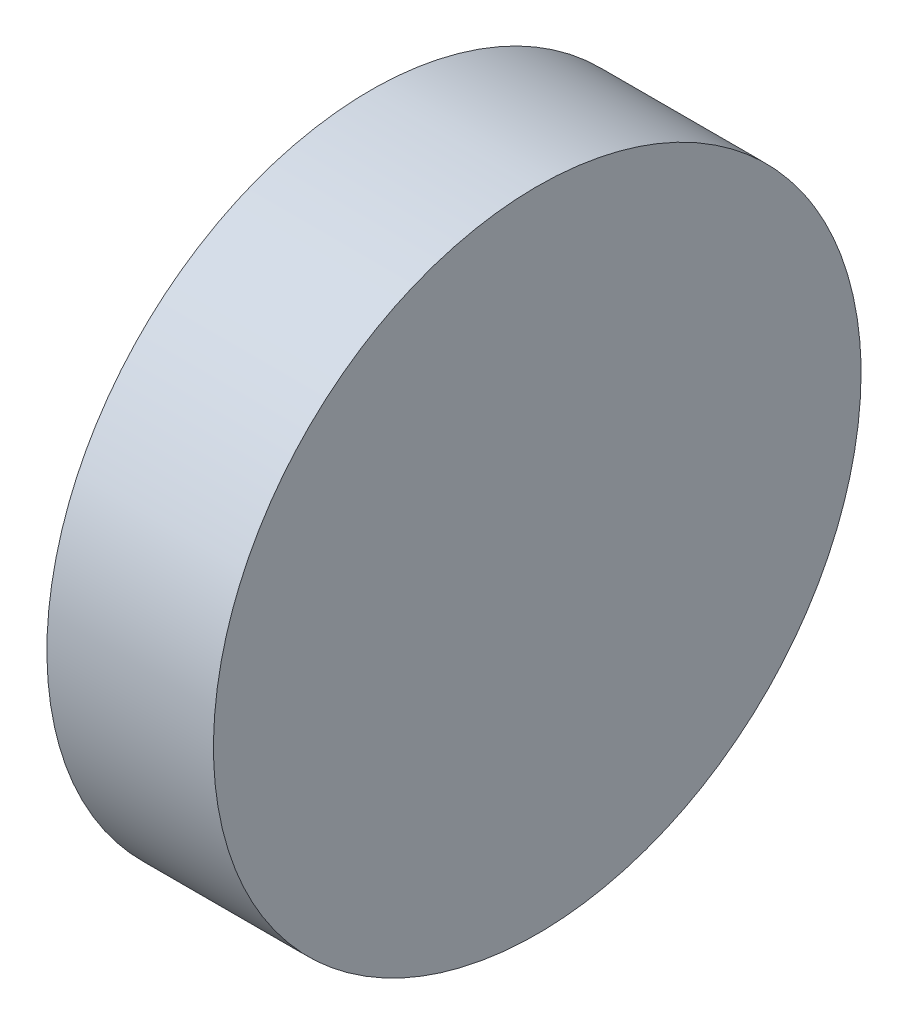
ISO-10303-21;
HEADER;
FILE_DESCRIPTION(('STEP AP214'),'2;1');
FILE_NAME('part.step','',(''),(''),'','','');
FILE_SCHEMA(('AUTOMOTIVE_DESIGN { 1 0 10303 214 1 1 1 1 }'));
ENDSEC;
DATA;
#1=APPLICATION_CONTEXT('core data for automotive mechanical design processes');
#2=APPLICATION_PROTOCOL_DEFINITION('international standard','automotive_design',2000,#1);
#3=PRODUCT_CONTEXT('',#1,'mechanical');
#4=PRODUCT('Part','Part','',(#3));
#5=PRODUCT_RELATED_PRODUCT_CATEGORY('part','',(#4));
#6=PRODUCT_DEFINITION_FORMATION('','',#4);
#7=PRODUCT_DEFINITION_CONTEXT('part definition',#1,'design');
#8=PRODUCT_DEFINITION('design','',#6,#7);
#9=PRODUCT_DEFINITION_SHAPE('','',#8);
#10=(LENGTH_UNIT() NAMED_UNIT(*) SI_UNIT(.MILLI.,.METRE.));
#11=(NAMED_UNIT(*) PLANE_ANGLE_UNIT() SI_UNIT($,.RADIAN.));
#12=(NAMED_UNIT(*) SI_UNIT($,.STERADIAN.) SOLID_ANGLE_UNIT());
#13=UNCERTAINTY_MEASURE_WITH_UNIT(LENGTH_MEASURE(1.E-05),#10,'distance_accuracy_value','');
#14=(GEOMETRIC_REPRESENTATION_CONTEXT(3) GLOBAL_UNCERTAINTY_ASSIGNED_CONTEXT((#13)) GLOBAL_UNIT_ASSIGNED_CONTEXT((#10,
#11,#12)) REPRESENTATION_CONTEXT('',''));
#15=CARTESIAN_POINT('',(0.,0.,0.));
#16=DIRECTION('',(0.,0.,1.));
#17=DIRECTION('',(1.,0.,0.));
#18=AXIS2_PLACEMENT_3D('',#15,#16,#17);
#19=CARTESIAN_POINT('',(24.3378726721836,45.4668382799999,-10.8103553390594));
#20=CARTESIAN_POINT('',(24.3378726721836,45.6350682592076,-10.8103553390594));
#21=CARTESIAN_POINT('',(24.3378726721836,45.9715282176228,-10.7434292922025));
#22=CARTESIAN_POINT('',(24.3378726721836,46.3993836872683,-10.4575454072685));
#23=CARTESIAN_POINT('',(24.3378726721836,46.6852675722024,-10.0296899376229));
#24=CARTESIAN_POINT('',(24.3378726721836,46.7856566424877,-9.52500000000003));
#25=CARTESIAN_POINT('',(24.3378726721836,46.6852675722024,-9.02031006237711));
#26=CARTESIAN_POINT('',(24.3378726721836,46.3993836872683,-8.5924545927316));
#27=CARTESIAN_POINT('',(24.3378726721836,45.9715282176228,-8.30657070779755));
#28=CARTESIAN_POINT('',(24.3378726721836,45.4668382799999,-8.20618163751228));
#29=CARTESIAN_POINT('',(24.3378726721836,44.962148342377,-8.30657070779755));
#30=CARTESIAN_POINT('',(24.3378726721836,44.5342928727315,-8.5924545927316));
#31=CARTESIAN_POINT('',(24.3378726721836,44.2484089877974,-9.02031006237711));
#32=CARTESIAN_POINT('',(24.3378726721836,44.1480199175122,-9.52500000000003));
#33=CARTESIAN_POINT('',(24.3378726721836,44.2484089877975,-10.029689937623));
#34=CARTESIAN_POINT('',(24.3378726721836,44.5342928727315,-10.4575454072685));
#35=CARTESIAN_POINT('',(24.3378726721836,44.962148342377,-10.7434292922025));
#36=CARTESIAN_POINT('',(24.3378726721836,45.2986083007923,-10.8103553390594));
#37=CARTESIAN_POINT('',(24.3378726721836,45.4668382799999,-10.8103553390594));
#38=B_SPLINE_CURVE_WITH_KNOTS('',3,(#19,#20,#21,#22,#23,#24,#25,#26,#27,#28,#29,#30,#31,#32,#33,
#34,#35,#36,#37),.UNSPECIFIED.,.T.,.F.,(4,1,1,1,1,1,1,1,1,1,1,1,1,1,1,1,4),(0.,
0.0624999999999997,0.125,0.1875,0.25,0.3125,0.375,0.4375,0.5,0.5625,0.625,0.6875,0.75,0.8125,
0.875,0.9375,1.),.UNSPECIFIED.);
#39=DIRECTION('',(1.,0.,0.));
#40=VECTOR('',#39,1.);
#41=SURFACE_OF_LINEAR_EXTRUSION('',#38,#40);
#42=CARTESIAN_POINT('',(24.3378726721836,45.4668382799999,-10.8103553390594));
#43=CARTESIAN_POINT('',(24.3378726721836,45.6350682592076,-10.8103553390594));
#44=CARTESIAN_POINT('',(24.3378726721836,45.9715282176228,-10.7434292922025));
#45=CARTESIAN_POINT('',(24.3378726721836,46.3993836872683,-10.4575454072685));
#46=CARTESIAN_POINT('',(24.3378726721836,46.6852675722024,-10.0296899376229));
#47=CARTESIAN_POINT('',(24.3378726721836,46.7856566424877,-9.52500000000003));
#48=CARTESIAN_POINT('',(24.3378726721836,46.6852675722024,-9.02031006237711));
#49=CARTESIAN_POINT('',(24.3378726721836,46.3993836872683,-8.5924545927316));
#50=CARTESIAN_POINT('',(24.3378726721836,45.9715282176228,-8.30657070779755));
#51=CARTESIAN_POINT('',(24.3378726721836,45.4668382799999,-8.20618163751228));
#52=CARTESIAN_POINT('',(24.3378726721836,44.962148342377,-8.30657070779755));
#53=CARTESIAN_POINT('',(24.3378726721836,44.5342928727315,-8.5924545927316));
#54=CARTESIAN_POINT('',(24.3378726721836,44.2484089877974,-9.02031006237711));
#55=CARTESIAN_POINT('',(24.3378726721836,44.1480199175122,-9.52500000000003));
#56=CARTESIAN_POINT('',(24.3378726721836,44.2484089877975,-10.029689937623));
#57=CARTESIAN_POINT('',(24.3378726721836,44.5342928727315,-10.4575454072685));
#58=CARTESIAN_POINT('',(24.3378726721836,44.962148342377,-10.7434292922025));
#59=CARTESIAN_POINT('',(24.3378726721836,45.2986083007923,-10.8103553390594));
#60=CARTESIAN_POINT('',(24.3378726721836,45.4668382799999,-10.8103553390594));
#61=B_SPLINE_CURVE_WITH_KNOTS('',3,(#42,#43,#44,#45,#46,#47,#48,#49,#50,#51,#52,#53,#54,#55,#56,
#57,#58,#59,#60),.UNSPECIFIED.,.T.,.F.,(4,1,1,1,1,1,1,1,1,1,1,1,1,1,1,1,4),(0.,
0.0624999999999997,0.125,0.1875,0.25,0.3125,0.375,0.4375,0.5,0.5625,0.625,0.6875,0.75,0.8125,
0.875,0.9375,1.),.UNSPECIFIED.);
#62=CARTESIAN_POINT('',(24.3378726721836,45.4668382799999,-10.8103553390594));
#63=VERTEX_POINT('',#62);
#64=EDGE_CURVE('E10',#63,#63,#61,.T.);
#65=ORIENTED_EDGE('',*,*,#64,.T.);
#66=EDGE_LOOP('',(#65));
#67=FACE_BOUND('',#66,.T.);
#68=CARTESIAN_POINT('',(24.999,45.4668382799999,-10.8103553390594));
#69=CARTESIAN_POINT('',(24.999,45.4458090364106,-10.8103553542836));
#70=CARTESIAN_POINT('',(24.999,45.424780229309,-10.8098324564651));
#71=CARTESIAN_POINT('',(24.999,45.3827726330485,-10.8077509520605));
#72=CARTESIAN_POINT('',(24.999,45.3617938469049,-10.8061922845425));
#73=CARTESIAN_POINT('',(24.999,45.3199364875203,-10.8020492182821));
#74=CARTESIAN_POINT('',(24.999,45.2990579212557,-10.7994647491513));
#75=CARTESIAN_POINT('',(24.999,45.257450894102,-10.7932800217818));
#76=CARTESIAN_POINT('',(24.999,45.2367224397265,-10.7896797197334));
#77=CARTESIAN_POINT('',(24.999,45.1954656188162,-10.7814732284895));
#78=CARTESIAN_POINT('',(24.999,45.1749372522814,-10.7768670392939));
#79=CARTESIAN_POINT('',(24.999,45.1341305707479,-10.7666586580684));
#80=CARTESIAN_POINT('',(24.999,45.1138522450021,-10.7610565090061));
#81=CARTESIAN_POINT('',(24.999,45.0735956369787,-10.7488661010483));
#82=CARTESIAN_POINT('',(24.999,45.0536173342061,-10.7422779098512));
#83=CARTESIAN_POINT('',(24.999,45.0140106969555,-10.7281252988193));
#84=CARTESIAN_POINT('',(24.999,44.9943823419584,-10.7205609364384));
#85=CARTESIAN_POINT('',(24.999,44.9555258321214,-10.7044660430837));
#86=CARTESIAN_POINT('',(24.999,44.9362976772815,-10.6959355121101));
#87=CARTESIAN_POINT('',(24.999,44.8982841482399,-10.6779367975247));
#88=CARTESIAN_POINT('',(24.999,44.8794988001549,-10.6684685587776));
#89=CARTESIAN_POINT('',(24.999,44.8424131596245,-10.6486227585291));
#90=CARTESIAN_POINT('',(24.999,44.8241129005571,-10.6382451346654));
#91=CARTESIAN_POINT('',(24.999,44.7880398032751,-10.6166088685027));
#92=CARTESIAN_POINT('',(24.999,44.7702669878441,-10.6053501882216));
#93=CARTESIAN_POINT('',(24.999,44.7352911461264,-10.5819800779427));
#94=CARTESIAN_POINT('',(24.999,44.7180881198398,-10.5698686479448));
#95=CARTESIAN_POINT('',(24.999,44.6842942396881,-10.5448212922901));
#96=CARTESIAN_POINT('',(24.999,44.6677033594512,-10.5318854022177));
#97=CARTESIAN_POINT('',(24.999,44.6351761705859,-10.5052173969397));
#98=CARTESIAN_POINT('',(24.999,44.6192398171156,-10.4914853364363));
#99=CARTESIAN_POINT('',(24.999,44.5880640253275,-10.4632532248685));
#100=CARTESIAN_POINT('',(24.999,44.5728245460658,-10.4487532190322));
#101=CARTESIAN_POINT('',(24.999,44.5430850609677,-10.4190137339342));
#102=CARTESIAN_POINT('',(24.999,44.5285850551314,-10.4037742546724));
#103=CARTESIAN_POINT('',(24.999,44.5003529435637,-10.3725984628843));
#104=CARTESIAN_POINT('',(24.999,44.4866208830602,-10.3566621094141));
#105=CARTESIAN_POINT('',(24.999,44.4599528777823,-10.3241349205488));
#106=CARTESIAN_POINT('',(24.999,44.4470169877098,-10.3075440403118));
#107=CARTESIAN_POINT('',(24.999,44.4219696320552,-10.2737501601602));
#108=CARTESIAN_POINT('',(24.999,44.4098582020573,-10.2565471338735));
#109=CARTESIAN_POINT('',(24.999,44.3864880917783,-10.2215712921559));
#110=CARTESIAN_POINT('',(24.999,44.3752294114973,-10.2037984767249));
#111=CARTESIAN_POINT('',(24.999,44.3535931453346,-10.1677253794427));
#112=CARTESIAN_POINT('',(24.999,44.3432155214709,-10.1494251203749));
#113=CARTESIAN_POINT('',(24.999,44.3233697212223,-10.1123394798456));
#114=CARTESIAN_POINT('',(24.999,44.3139014824752,-10.0935541317618));
#115=CARTESIAN_POINT('',(24.999,44.29590276789,-10.0555406027166));
#116=CARTESIAN_POINT('',(24.999,44.2873722369166,-10.0363124478719));
#117=CARTESIAN_POINT('',(24.999,44.2712773435612,-9.99745593804824));
#118=CARTESIAN_POINT('',(24.999,44.2637129811791,-9.97782758306942));
#119=CARTESIAN_POINT('',(24.999,44.2495603701503,-9.93822094576891));
#120=CARTESIAN_POINT('',(24.999,44.2429721789573,-9.91824264292795));
#121=CARTESIAN_POINT('',(24.999,44.2307817709882,-9.87798603509111));
#122=CARTESIAN_POINT('',(24.999,44.2251796219105,-9.85770770960022));
#123=CARTESIAN_POINT('',(24.999,44.214971240727,-9.81690102737035));
#124=CARTESIAN_POINT('',(24.999,44.210365051589,-9.7963726598844));
#125=CARTESIAN_POINT('',(24.999,44.2021585601881,-9.75511584157285));
#126=CARTESIAN_POINT('',(24.999,44.1985582579252,-9.73438739074724));
#127=CARTESIAN_POINT('',(24.999,44.1923735311416,-9.69278035389519));
#128=CARTESIAN_POINT('',(24.999,44.1897890628111,-9.67190177438288));
#129=CARTESIAN_POINT('',(24.999,44.1856459943643,-9.63004445119056));
#130=CARTESIAN_POINT('',(24.999,44.1840873238597,-9.60906571448267));
#131=CARTESIAN_POINT('',(24.999,44.1820058276143,-9.56705798316369));
#132=CARTESIAN_POINT('',(24.999,44.1814829409406,-9.54602899158186));
#133=CARTESIAN_POINT('',(24.999,44.1814829409406,-9.5039710084182));
#134=CARTESIAN_POINT('',(24.999,44.1820058276143,-9.48294201683636));
#135=CARTESIAN_POINT('',(24.999,44.1840873238597,-9.44093428551739));
#136=CARTESIAN_POINT('',(24.999,44.1856459943643,-9.4199555488095));
#137=CARTESIAN_POINT('',(24.999,44.1897890628111,-9.37809822561718));
#138=CARTESIAN_POINT('',(24.999,44.1923735311416,-9.35721964610487));
#139=CARTESIAN_POINT('',(24.999,44.1985582579252,-9.31561260925282));
#140=CARTESIAN_POINT('',(24.999,44.2021585601881,-9.29488415842721));
#141=CARTESIAN_POINT('',(24.999,44.210365051589,-9.25362734011565));
#142=CARTESIAN_POINT('',(24.999,44.214971240727,-9.23309897262971));
#143=CARTESIAN_POINT('',(24.999,44.2251796219105,-9.19229229039984));
#144=CARTESIAN_POINT('',(24.999,44.2307817709882,-9.17201396490895));
#145=CARTESIAN_POINT('',(24.999,44.2429721789573,-9.13175735707211));
#146=CARTESIAN_POINT('',(24.999,44.2495603701503,-9.11177905423115));
#147=CARTESIAN_POINT('',(24.999,44.2637129811791,-9.07217241693064));
#148=CARTESIAN_POINT('',(24.999,44.2712773435612,-9.05254406195182));
#149=CARTESIAN_POINT('',(24.999,44.2873722369166,-9.01368755212821));
#150=CARTESIAN_POINT('',(24.999,44.2959027678899,-8.99445939728341));
#151=CARTESIAN_POINT('',(24.999,44.3139014824752,-8.95644586823826));
#152=CARTESIAN_POINT('',(24.999,44.3233697212223,-8.93766052015449));
#153=CARTESIAN_POINT('',(24.999,44.3432155214709,-8.90057487962514));
#154=CARTESIAN_POINT('',(24.999,44.3535931453346,-8.88227462055736));
#155=CARTESIAN_POINT('',(24.999,44.3752294114973,-8.84620152327513));
#156=CARTESIAN_POINT('',(24.999,44.3864880917783,-8.82842870784418));
#157=CARTESIAN_POINT('',(24.999,44.4098582020573,-8.79345286612657));
#158=CARTESIAN_POINT('',(24.999,44.4219696320552,-8.7762498398399));
#159=CARTESIAN_POINT('',(24.999,44.4470169877098,-8.74245595968822));
#160=CARTESIAN_POINT('',(24.999,44.4599528777823,-8.72586507945126));
#161=CARTESIAN_POINT('',(24.999,44.4866208830602,-8.693337890586));
#162=CARTESIAN_POINT('',(24.999,44.5003529435637,-8.67740153711574));
#163=CARTESIAN_POINT('',(24.999,44.5285850551314,-8.64622574532764));
#164=CARTESIAN_POINT('',(24.999,44.5430850609677,-8.63098626606587));
#165=CARTESIAN_POINT('',(24.999,44.5728245460658,-8.60124678096782));
#166=CARTESIAN_POINT('',(24.999,44.5880640253275,-8.58674677513153));
#167=CARTESIAN_POINT('',(24.999,44.6192398171156,-8.55851466356381));
#168=CARTESIAN_POINT('',(24.999,44.6351761705859,-8.54478260306032));
#169=CARTESIAN_POINT('',(24.999,44.6677033594511,-8.51811459778236));
#170=CARTESIAN_POINT('',(24.999,44.6842942396881,-8.50517870770993));
#171=CARTESIAN_POINT('',(24.999,44.7180881198398,-8.48013135205528));
#172=CARTESIAN_POINT('',(24.999,44.7352911461265,-8.4680199220574));
#173=CARTESIAN_POINT('',(24.999,44.7702669878441,-8.44464981177844));
#174=CARTESIAN_POINT('',(24.999,44.788039803275,-8.43339113149737));
#175=CARTESIAN_POINT('',(24.999,44.8241129005572,-8.41175486533468));
#176=CARTESIAN_POINT('',(24.999,44.842413159625,-8.40137724147103));
#177=CARTESIAN_POINT('',(24.999,44.8794988001544,-8.38153144122239));
#178=CARTESIAN_POINT('',(24.999,44.8982841482381,-8.37206320247527));
#179=CARTESIAN_POINT('',(24.999,44.9362976772833,-8.35406448789006));
#180=CARTESIAN_POINT('',(24.999,44.9555258321281,-8.34553395691673));
#181=CARTESIAN_POINT('',(24.999,44.9943823419517,-8.3294390635613));
#182=CARTESIAN_POINT('',(24.999,45.0140106969305,-8.32187470117921));
#183=CARTESIAN_POINT('',(24.999,45.053617334231,-8.30772209015039));
#184=CARTESIAN_POINT('',(24.999,45.073595637072,-8.30113389895739));
#185=CARTESIAN_POINT('',(24.999,45.1138522449088,-8.28894349098833));
#186=CARTESIAN_POINT('',(24.999,45.1341305703997,-8.28334134191063));
#187=CARTESIAN_POINT('',(24.999,45.1749372526296,-8.27313296072715));
#188=CARTESIAN_POINT('',(24.999,45.1954656201155,-8.26852677158911));
#189=CARTESIAN_POINT('',(24.999,45.2367224384271,-8.2603202801882));
#190=CARTESIAN_POINT('',(24.999,45.2574508892527,-8.25671997792534));
#191=CARTESIAN_POINT('',(24.999,45.2990579261048,-8.25053525114167));
#192=CARTESIAN_POINT('',(24.999,45.3199365056171,-8.24795078281116));
#193=CARTESIAN_POINT('',(24.999,45.3617938288094,-8.24380771436437));
#194=CARTESIAN_POINT('',(24.999,45.3827725655173,-8.24224904385984));
#195=CARTESIAN_POINT('',(24.999,45.4247802968363,-8.24016754761437));
#196=CARTESIAN_POINT('',(24.999,45.4458092884181,-8.23964466094071));
#197=CARTESIAN_POINT('',(24.999,45.4878672715818,-8.23964466094071));
#198=CARTESIAN_POINT('',(24.999,45.5088962631636,-8.24016754761437));
#199=CARTESIAN_POINT('',(24.999,45.5509039944826,-8.24224904385984));
#200=CARTESIAN_POINT('',(24.999,45.5718827311905,-8.24380771436437));
#201=CARTESIAN_POINT('',(24.999,45.6137400543828,-8.24795078281117));
#202=CARTESIAN_POINT('',(24.999,45.6346186338951,-8.25053525114167));
#203=CARTESIAN_POINT('',(24.999,45.6762256707471,-8.25671997792534));
#204=CARTESIAN_POINT('',(24.999,45.6969541215727,-8.2603202801882));
#205=CARTESIAN_POINT('',(24.999,45.7382109398843,-8.26852677158911));
#206=CARTESIAN_POINT('',(24.999,45.7587393073702,-8.27313296072715));
#207=CARTESIAN_POINT('',(24.999,45.7995459896001,-8.28334134191063));
#208=CARTESIAN_POINT('',(24.999,45.819824315091,-8.28894349098833));
#209=CARTESIAN_POINT('',(24.999,45.8600809229278,-8.30113389895739));
#210=CARTESIAN_POINT('',(24.999,45.8800592257688,-8.30772209015039));
#211=CARTESIAN_POINT('',(24.999,45.9196658630693,-8.32187470117921));
#212=CARTESIAN_POINT('',(24.999,45.9392942180481,-8.3294390635613));
#213=CARTESIAN_POINT('',(24.999,45.9781507278717,-8.34553395691673));
#214=CARTESIAN_POINT('',(24.999,45.9973788827165,-8.35406448789006));
#215=CARTESIAN_POINT('',(24.999,46.0353924117617,-8.37206320247527));
#216=CARTESIAN_POINT('',(24.999,46.0541777598455,-8.38153144122238));
#217=CARTESIAN_POINT('',(24.999,46.0912634003748,-8.40137724147103));
#218=CARTESIAN_POINT('',(24.999,46.1095636594426,-8.41175486533469));
#219=CARTESIAN_POINT('',(24.999,46.1456367567248,-8.43339113149738));
#220=CARTESIAN_POINT('',(24.999,46.1634095721558,-8.44464981177844));
#221=CARTESIAN_POINT('',(24.999,46.1983854138734,-8.46801992205739));
#222=CARTESIAN_POINT('',(24.999,46.21558844016,-8.48013135205528));
#223=CARTESIAN_POINT('',(24.999,46.2493823203117,-8.50517870770993));
#224=CARTESIAN_POINT('',(24.999,46.2659732005487,-8.51811459778236));
#225=CARTESIAN_POINT('',(24.999,46.2985003894139,-8.54478260306032));
#226=CARTESIAN_POINT('',(24.999,46.3144367428842,-8.55851466356381));
#227=CARTESIAN_POINT('',(24.999,46.3456125346723,-8.58674677513152));
#228=CARTESIAN_POINT('',(24.999,46.3608520139341,-8.60124678096782));
#229=CARTESIAN_POINT('',(24.999,46.3905914990321,-8.63098626606588));
#230=CARTESIAN_POINT('',(24.999,46.4050915048684,-8.64622574532764));
#231=CARTESIAN_POINT('',(24.999,46.4333236164361,-8.67740153711574));
#232=CARTESIAN_POINT('',(24.999,46.4470556769396,-8.693337890586));
#233=CARTESIAN_POINT('',(24.999,46.4737236822176,-8.72586507945126));
#234=CARTESIAN_POINT('',(24.999,46.48665957229,-8.74245595968822));
#235=CARTESIAN_POINT('',(24.999,46.5117069279447,-8.7762498398399));
#236=CARTESIAN_POINT('',(24.999,46.5238183579426,-8.79345286612657));
#237=CARTESIAN_POINT('',(24.999,46.5471884682215,-8.82842870784418));
#238=CARTESIAN_POINT('',(24.999,46.5584471485026,-8.84620152327513));
#239=CARTESIAN_POINT('',(24.999,46.5800834146653,-8.88227462055736));
#240=CARTESIAN_POINT('',(24.999,46.5904610385289,-8.90057487962514));
#241=CARTESIAN_POINT('',(24.999,46.6103068387776,-8.93766052015449));
#242=CARTESIAN_POINT('',(24.999,46.6197750775247,-8.95644586823826));
#243=CARTESIAN_POINT('',(24.999,46.6377737921099,-8.99445939728341));
#244=CARTESIAN_POINT('',(24.999,46.6463043230832,-9.01368755212821));
#245=CARTESIAN_POINT('',(24.999,46.6623992164387,-9.05254406195182));
#246=CARTESIAN_POINT('',(24.999,46.6699635788207,-9.07217241693064));
#247=CARTESIAN_POINT('',(24.999,46.6841161898496,-9.11177905423115));
#248=CARTESIAN_POINT('',(24.999,46.6907043810426,-9.13175735707211));
#249=CARTESIAN_POINT('',(24.999,46.7028947890116,-9.17201396490895));
#250=CARTESIAN_POINT('',(24.999,46.7084969380893,-9.19229229039984));
#251=CARTESIAN_POINT('',(24.999,46.7187053192728,-9.23309897262971));
#252=CARTESIAN_POINT('',(24.999,46.7233115084109,-9.25362734011566));
#253=CARTESIAN_POINT('',(24.999,46.7315179998118,-9.29488415842721));
#254=CARTESIAN_POINT('',(24.999,46.7351183020746,-9.31561260925282));
#255=CARTESIAN_POINT('',(24.999,46.7413030288583,-9.35721964610487));
#256=CARTESIAN_POINT('',(24.999,46.7438874971888,-9.37809822561718));
#257=CARTESIAN_POINT('',(24.999,46.7480305656356,-9.4199555488095));
#258=CARTESIAN_POINT('',(24.999,46.7495892361401,-9.44093428551739));
#259=CARTESIAN_POINT('',(24.999,46.7516707323856,-9.48294201683636));
#260=CARTESIAN_POINT('',(24.999,46.7521936190592,-9.5039710084182));
#261=CARTESIAN_POINT('',(24.999,46.7521936190592,-9.54602899158186));
#262=CARTESIAN_POINT('',(24.999,46.7516707323856,-9.56705798316369));
#263=CARTESIAN_POINT('',(24.999,46.7495892361401,-9.60906571448267));
#264=CARTESIAN_POINT('',(24.999,46.7480305656356,-9.63004445119056));
#265=CARTESIAN_POINT('',(24.999,46.7438874971888,-9.67190177438288));
#266=CARTESIAN_POINT('',(24.999,46.7413030288583,-9.69278035389519));
#267=CARTESIAN_POINT('',(24.999,46.7351183020746,-9.73438739074724));
#268=CARTESIAN_POINT('',(24.999,46.7315179998118,-9.75511584157285));
#269=CARTESIAN_POINT('',(24.999,46.7233115084108,-9.7963726598844));
#270=CARTESIAN_POINT('',(24.999,46.7187053192728,-9.81690102737035));
#271=CARTESIAN_POINT('',(24.999,46.7084969380893,-9.85770770960022));
#272=CARTESIAN_POINT('',(24.999,46.7028947890116,-9.87798603509111));
#273=CARTESIAN_POINT('',(24.999,46.6907043810426,-9.91824264292795));
#274=CARTESIAN_POINT('',(24.999,46.6841161898496,-9.93822094576891));
#275=CARTESIAN_POINT('',(24.999,46.6699635788207,-9.97782758306942));
#276=CARTESIAN_POINT('',(24.999,46.6623992164386,-9.99745593804824));
#277=CARTESIAN_POINT('',(24.999,46.6463043230832,-10.0363124478719));
#278=CARTESIAN_POINT('',(24.999,46.6377737921099,-10.0555406027166));
#279=CARTESIAN_POINT('',(24.999,46.6197750775247,-10.0935541317618));
#280=CARTESIAN_POINT('',(24.999,46.6103068387776,-10.1123394798456));
#281=CARTESIAN_POINT('',(24.999,46.5904610385289,-10.1494251203749));
#282=CARTESIAN_POINT('',(24.999,46.5800834146653,-10.1677253794427));
#283=CARTESIAN_POINT('',(24.999,46.5584471485026,-10.2037984767249));
#284=CARTESIAN_POINT('',(24.999,46.5471884682215,-10.2215712921559));
#285=CARTESIAN_POINT('',(24.999,46.5238183579426,-10.2565471338735));
#286=CARTESIAN_POINT('',(24.999,46.5117069279447,-10.2737501601602));
#287=CARTESIAN_POINT('',(24.999,46.48665957229,-10.3075440403118));
#288=CARTESIAN_POINT('',(24.999,46.4737236822176,-10.3241349205488));
#289=CARTESIAN_POINT('',(24.999,46.4470556769396,-10.3566621094141));
#290=CARTESIAN_POINT('',(24.999,46.4333236164361,-10.3725984628843));
#291=CARTESIAN_POINT('',(24.999,46.4050915048684,-10.4037742546724));
#292=CARTESIAN_POINT('',(24.999,46.3905914990321,-10.4190137339342));
#293=CARTESIAN_POINT('',(24.999,46.3608520139341,-10.4487532190322));
#294=CARTESIAN_POINT('',(24.999,46.3456125346723,-10.4632532248685));
#295=CARTESIAN_POINT('',(24.999,46.3144367428842,-10.4914853364363));
#296=CARTESIAN_POINT('',(24.999,46.298500389414,-10.5052173969397));
#297=CARTESIAN_POINT('',(24.999,46.2659732005487,-10.5318854022177));
#298=CARTESIAN_POINT('',(24.999,46.2493823203117,-10.5448212922901));
#299=CARTESIAN_POINT('',(24.999,46.2155884401601,-10.5698686479448));
#300=CARTESIAN_POINT('',(24.999,46.1983854138734,-10.5819800779427));
#301=CARTESIAN_POINT('',(24.999,46.1634095721557,-10.6053501882216));
#302=CARTESIAN_POINT('',(24.999,46.1456367567247,-10.6166088685027));
#303=CARTESIAN_POINT('',(24.999,46.1095636594427,-10.6382451346654));
#304=CARTESIAN_POINT('',(24.999,46.0912634003753,-10.6486227585291));
#305=CARTESIAN_POINT('',(24.999,46.054177759845,-10.6684685587776));
#306=CARTESIAN_POINT('',(24.999,46.0353924117599,-10.6779367975247));
#307=CARTESIAN_POINT('',(24.999,45.9973788827183,-10.6959355121101));
#308=CARTESIAN_POINT('',(24.999,45.9781507278784,-10.7044660430837));
#309=CARTESIAN_POINT('',(24.999,45.9392942180414,-10.7205609364384));
#310=CARTESIAN_POINT('',(24.999,45.9196658630443,-10.7281252988193));
#311=CARTESIAN_POINT('',(24.999,45.8800592257938,-10.7422779098512));
#312=CARTESIAN_POINT('',(24.999,45.8600809230211,-10.7488661010483));
#313=CARTESIAN_POINT('',(24.999,45.8198243149977,-10.7610565090061));
#314=CARTESIAN_POINT('',(24.999,45.799545989252,-10.7666586580684));
#315=CARTESIAN_POINT('',(24.999,45.7587393077184,-10.7768670392939));
#316=CARTESIAN_POINT('',(24.999,45.7382109411837,-10.7814732284895));
#317=CARTESIAN_POINT('',(24.999,45.6969541202734,-10.7896797197334));
#318=CARTESIAN_POINT('',(24.999,45.6762256658978,-10.7932800217818));
#319=CARTESIAN_POINT('',(24.999,45.6346186387442,-10.7994647491513));
#320=CARTESIAN_POINT('',(24.999,45.6137400724795,-10.8020492182821));
#321=CARTESIAN_POINT('',(24.999,45.5718827130949,-10.8061922845425));
#322=CARTESIAN_POINT('',(24.999,45.5509039269514,-10.8077509520605));
#323=CARTESIAN_POINT('',(24.999,45.5088963306908,-10.8098324564651));
#324=CARTESIAN_POINT('',(24.999,45.4878675235893,-10.8103553542836));
#325=CARTESIAN_POINT('',(24.999,45.4668382799999,-10.8103553390594));
#326=B_SPLINE_CURVE_WITH_KNOTS('',3,(#68,#69,#70,#71,#72,#73,#74,#75,#76,#77,#78,#79,#80,#81,
#82,#83,#84,#85,#86,#87,#88,#89,#90,#91,#92,#93,#94,#95,#96,#97,#98,#99,#100,#101,#102,#103,
#104,#105,#106,#107,#108,#109,#110,#111,#112,#113,#114,#115,#116,#117,#118,#119,#120,#121,#122,
#123,#124,#125,#126,#127,#128,#129,#130,#131,#132,#133,#134,#135,#136,#137,#138,#139,#140,#141,
#142,#143,#144,#145,#146,#147,#148,#149,#150,#151,#152,#153,#154,#155,#156,#157,#158,#159,#160,
#161,#162,#163,#164,#165,#166,#167,#168,#169,#170,#171,#172,#173,#174,#175,#176,#177,#178,#179,
#180,#181,#182,#183,#184,#185,#186,#187,#188,#189,#190,#191,#192,#193,#194,#195,#196,#197,#198,
#199,#200,#201,#202,#203,#204,#205,#206,#207,#208,#209,#210,#211,#212,#213,#214,#215,#216,#217,
#218,#219,#220,#221,#222,#223,#224,#225,#226,#227,#228,#229,#230,#231,#232,#233,#234,#235,#236,
#237,#238,#239,#240,#241,#242,#243,#244,#245,#246,#247,#248,#249,#250,#251,#252,#253,#254,#255,
#256,#257,#258,#259,#260,#261,#262,#263,#264,#265,#266,#267,#268,#269,#270,#271,#272,#273,#274,
#275,#276,#277,#278,#279,#280,#281,#282,#283,#284,#285,#286,#287,#288,#289,#290,#291,#292,#293,
#294,#295,#296,#297,#298,#299,#300,#301,#302,#303,#304,#305,#306,#307,#308,#309,#310,#311,#312,
#313,#314,#315,#316,#317,#318,#319,#320,#321,#322,#323,#324,#325),.UNSPECIFIED.,.F.,.F.,(4,2,2,
2,2,2,2,2,2,2,2,2,2,2,2,2,2,2,2,2,2,2,2,2,2,2,2,2,2,2,2,2,2,2,2,2,2,2,2,2,2,2,2,2,2,2,2,2,2,2,2,
2,2,2,2,2,2,2,2,2,2,2,2,2,2,2,2,2,2,2,2,2,2,2,2,2,2,2,2,2,2,2,2,2,2,2,2,2,2,2,2,2,2,2,2,2,2,2,2,
2,2,2,2,2,2,2,2,2,2,2,2,2,2,2,2,2,2,2,2,2,2,2,2,2,2,2,2,2,4),(0.,0.0630806127990775,
0.126164936809585,0.189253590290846,0.252344965001659,0.31543633971246,0.378524993193716,
0.441609317204225,0.504689930003313,0.567770542802389,0.630854866812904,0.693943520294158,
0.757034895004966,0.820126269715769,0.88321492319703,0.946299247207536,1.00937986000662,
1.0724604728057,1.13554479681621,1.19863345029746,1.26172482500827,1.32481619971907,
1.38790485320033,1.45098917721084,1.51406979000992,1.577150402809,1.64023472681951,
1.70332338030077,1.76641475501158,1.82950612972239,1.89259478320365,1.95567910721416,
2.01875972001323,2.08184033281231,2.14492465682282,2.20801331030408,2.27110468501489,
2.33419605972569,2.39728471320695,2.46036903721746,2.52344965001654,2.58653026281562,
2.64961458682613,2.71270324030739,2.7757946150182,2.83888598972901,2.90197464321027,
2.96505896722077,3.02813958001985,3.09122019281893,3.15430451682943,3.2173931703107,
3.28048454502151,3.3435759197323,3.40666457321357,3.46974889722408,3.53282951002316,
3.59591012282224,3.65899444683274,3.72208310031401,3.78517447502482,3.84826584973562,
3.91135450321688,3.9744388272274,4.03751944002647,4.10060005282555,4.16368437683606,
4.22677303031731,4.28986440502813,4.35295577973893,4.41604443322018,4.47912875723069,
4.54220937002977,4.60528998282885,4.66837430683936,4.73146296032062,4.79455433503142,
4.85764570974223,4.92073436322348,4.983818687234,5.04689930003308,5.10997991283216,
5.17306423684267,5.23615289032393,5.29924426503474,5.36233563974555,5.42542429322681,
5.48850861723732,5.5515892300364,5.61466984283547,5.67775416684598,5.74084282032725,
5.80393419503805,5.86702556974886,5.93011422323011,5.99319854724062,6.0562791600397,
6.11935977283878,6.18244409684929,6.24553275033055,6.30862412504136,6.37171549975216,
6.43480415323342,6.49788847724393,6.56096909004301,6.62404970284208,6.68713402685259,
6.75022268033386,6.81331405504466,6.87640542975547,6.93949408323673,7.00257840724724,
7.06565902004632,7.1287396328454,7.19182395685591,7.25491261033716,7.31800398504797,
7.38109535975877,7.44418401324003,7.50726833725054,7.57034895004962,7.63342956284871,
7.69651388685922,7.75960254034047,7.82269391505127,7.88578528976208,7.94887394324334,
8.01195826725385,8.07503888005293),.UNSPECIFIED.);
#327=CARTESIAN_POINT('',(24.999,45.4668382799999,-10.8103553390594));
#328=VERTEX_POINT('',#327);
#329=EDGE_CURVE('E25',#328,#328,#326,.F.);
#330=ORIENTED_EDGE('',*,*,#329,.F.);
#331=EDGE_LOOP('',(#330));
#332=FACE_BOUND('',#331,.T.);
#333=ADVANCED_FACE('F15',(#67,#332),#41,.T.);
#334=CARTESIAN_POINT('',(24.3378726721836,38.7605359730097,-3.00738998868599));
#335=DIRECTION('',(1.,0.,0.));
#336=DIRECTION('',(0.,1.,0.));
#337=AXIS2_PLACEMENT_3D('',#334,#335,#336);
#338=PLANE('',#337);
#339=ORIENTED_EDGE('',*,*,#64,.F.);
#340=EDGE_LOOP('',(#339));
#341=FACE_BOUND('',#340,.T.);
#342=ADVANCED_FACE('F63',(#341),#338,.F.);
#343=CARTESIAN_POINT('',(24.999,38.7605359730097,-3.00738998868599));
#344=DIRECTION('',(1.,0.,0.));
#345=DIRECTION('',(0.,1.,0.));
#346=AXIS2_PLACEMENT_3D('',#343,#344,#345);
#347=PLANE('',#346);
#348=ORIENTED_EDGE('',*,*,#329,.T.);
#349=EDGE_LOOP('',(#348));
#350=FACE_BOUND('',#349,.T.);
#351=ADVANCED_FACE('F32',(#350),#347,.T.);
#352=CLOSED_SHELL('',(#333,#342,#351));
#353=MANIFOLD_SOLID_BREP('B1',#352);
#354=ADVANCED_BREP_SHAPE_REPRESENTATION('',(#18,#353),#14);
#355=SHAPE_DEFINITION_REPRESENTATION(#9,#354);
ENDSEC;
END-ISO-10303-21;
